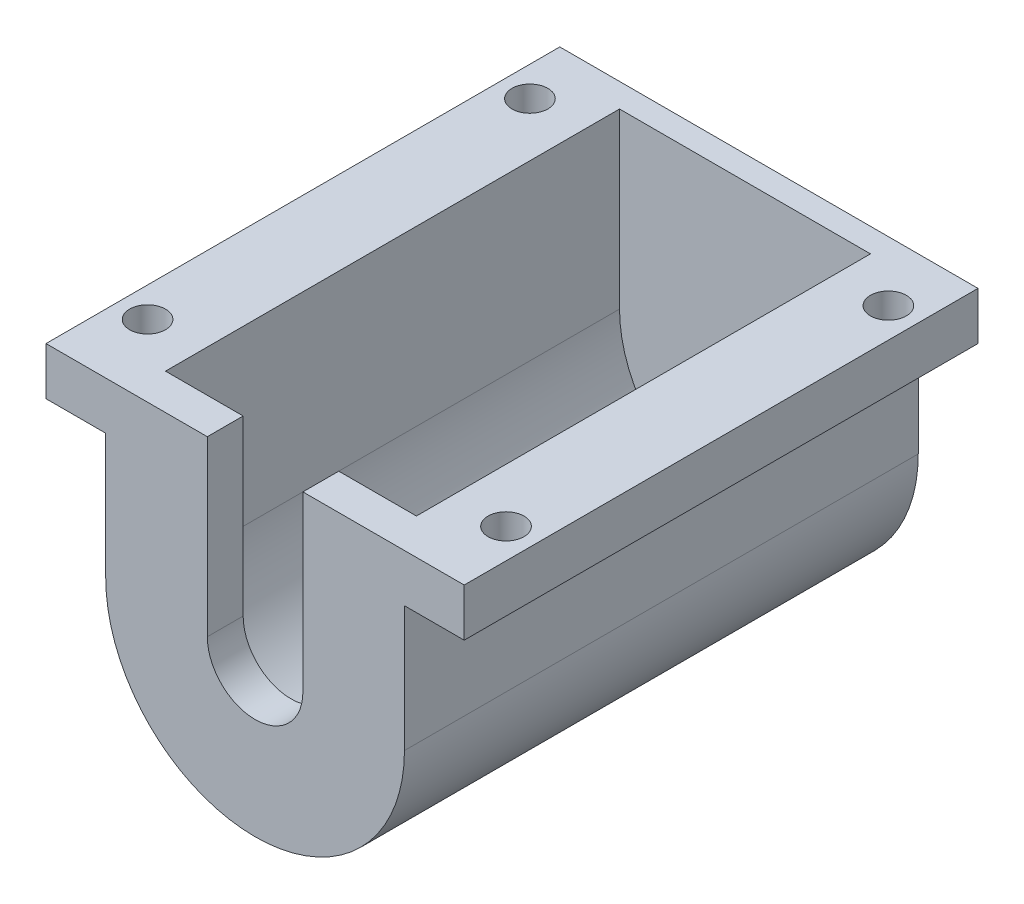
ISO-10303-21;
HEADER;
FILE_DESCRIPTION(('STEP AP214'),'2;1');
FILE_NAME('part.step','',(''),(''),'','','');
FILE_SCHEMA(('AUTOMOTIVE_DESIGN { 1 0 10303 214 1 1 1 1 }'));
ENDSEC;
DATA;
#1=APPLICATION_CONTEXT('core data for automotive mechanical design processes');
#2=APPLICATION_PROTOCOL_DEFINITION('international standard','automotive_design',2000,#1);
#3=PRODUCT_CONTEXT('',#1,'mechanical');
#4=PRODUCT('Part','Part','',(#3));
#5=PRODUCT_RELATED_PRODUCT_CATEGORY('part','',(#4));
#6=PRODUCT_DEFINITION_FORMATION('','',#4);
#7=PRODUCT_DEFINITION_CONTEXT('part definition',#1,'design');
#8=PRODUCT_DEFINITION('design','',#6,#7);
#9=PRODUCT_DEFINITION_SHAPE('','',#8);
#10=(LENGTH_UNIT() NAMED_UNIT(*) SI_UNIT(.MILLI.,.METRE.));
#11=(NAMED_UNIT(*) PLANE_ANGLE_UNIT() SI_UNIT($,.RADIAN.));
#12=(NAMED_UNIT(*) SI_UNIT($,.STERADIAN.) SOLID_ANGLE_UNIT());
#13=UNCERTAINTY_MEASURE_WITH_UNIT(LENGTH_MEASURE(1.E-05),#10,'distance_accuracy_value','');
#14=(GEOMETRIC_REPRESENTATION_CONTEXT(3) GLOBAL_UNCERTAINTY_ASSIGNED_CONTEXT((#13)) GLOBAL_UNIT_ASSIGNED_CONTEXT((#10,
#11,#12)) REPRESENTATION_CONTEXT('',''));
#15=CARTESIAN_POINT('',(0.,0.,0.));
#16=DIRECTION('',(0.,0.,1.));
#17=DIRECTION('',(1.,0.,0.));
#18=AXIS2_PLACEMENT_3D('',#15,#16,#17);
#19=CARTESIAN_POINT('',(12.5,10.5,38.));
#20=DIRECTION('',(-1.,0.,0.));
#21=DIRECTION('',(0.,0.,1.));
#22=AXIS2_PLACEMENT_3D('',#19,#20,#21);
#23=PLANE('',#22);
#24=DIRECTION('',(0.,0.,-1.));
#25=VECTOR('',#24,1.);
#26=CARTESIAN_POINT('',(12.5,0.,38.));
#27=LINE('',#26,#25);
#28=CARTESIAN_POINT('',(12.5,0.,41.));
#29=VERTEX_POINT('',#28);
#30=CARTESIAN_POINT('',(12.5,0.,-2.));
#31=VERTEX_POINT('',#30);
#32=EDGE_CURVE('E220',#29,#31,#27,.T.);
#33=ORIENTED_EDGE('',*,*,#32,.T.);
#34=DIRECTION('',(0.,-1.,0.));
#35=VECTOR('',#34,1.);
#36=CARTESIAN_POINT('',(12.5,10.5,-2.));
#37=LINE('',#36,#35);
#38=CARTESIAN_POINT('',(12.5,10.5,-2.));
#39=VERTEX_POINT('',#38);
#40=EDGE_CURVE('E169',#39,#31,#37,.T.);
#41=ORIENTED_EDGE('',*,*,#40,.F.);
#42=DIRECTION('',(0.,0.,-1.));
#43=VECTOR('',#42,1.);
#44=CARTESIAN_POINT('',(12.5,10.5,38.));
#45=LINE('',#44,#43);
#46=CARTESIAN_POINT('',(12.5,10.5,41.));
#47=VERTEX_POINT('',#46);
#48=EDGE_CURVE('E11',#47,#39,#45,.T.);
#49=ORIENTED_EDGE('',*,*,#48,.F.);
#50=DIRECTION('',(0.,1.,0.));
#51=VECTOR('',#50,1.);
#52=CARTESIAN_POINT('',(12.5,10.5,41.));
#53=LINE('',#52,#51);
#54=EDGE_CURVE('E192',#29,#47,#53,.T.);
#55=ORIENTED_EDGE('',*,*,#54,.F.);
#56=EDGE_LOOP('',(#33,#41,#49,#55));
#57=FACE_BOUND('',#56,.T.);
#58=ADVANCED_FACE('F32',(#57),#23,.F.);
#59=CARTESIAN_POINT('',(10.5,10.5,38.));
#60=DIRECTION('',(1.,0.,0.));
#61=DIRECTION('',(0.,1.,0.));
#62=AXIS2_PLACEMENT_3D('',#59,#60,#61);
#63=PLANE('',#62);
#64=DIRECTION('',(0.,-1.,0.));
#65=VECTOR('',#64,1.);
#66=CARTESIAN_POINT('',(10.5,10.5,0.));
#67=LINE('',#66,#65);
#68=CARTESIAN_POINT('',(10.5,14.5,0.));
#69=VERTEX_POINT('',#68);
#70=CARTESIAN_POINT('',(10.5,0.,0.));
#71=VERTEX_POINT('',#70);
#72=EDGE_CURVE('E210',#69,#71,#67,.T.);
#73=ORIENTED_EDGE('',*,*,#72,.T.);
#74=DIRECTION('',(0.,0.,-1.));
#75=VECTOR('',#74,1.);
#76=CARTESIAN_POINT('',(10.5,0.,38.));
#77=LINE('',#76,#75);
#78=CARTESIAN_POINT('',(10.5,0.,38.));
#79=VERTEX_POINT('',#78);
#80=EDGE_CURVE('E40',#79,#71,#77,.T.);
#81=ORIENTED_EDGE('',*,*,#80,.F.);
#82=DIRECTION('',(0.,-1.,0.));
#83=VECTOR('',#82,1.);
#84=CARTESIAN_POINT('',(10.5,10.5,38.));
#85=LINE('',#84,#83);
#86=CARTESIAN_POINT('',(10.5,14.5,38.));
#87=VERTEX_POINT('',#86);
#88=EDGE_CURVE('E211',#87,#79,#85,.T.);
#89=ORIENTED_EDGE('',*,*,#88,.F.);
#90=DIRECTION('',(0.,0.,1.));
#91=VECTOR('',#90,1.);
#92=CARTESIAN_POINT('',(10.5,14.5,0.));
#93=LINE('',#92,#91);
#94=EDGE_CURVE('E239',#69,#87,#93,.T.);
#95=ORIENTED_EDGE('',*,*,#94,.F.);
#96=EDGE_LOOP('',(#73,#81,#89,#95));
#97=FACE_BOUND('',#96,.T.);
#98=ADVANCED_FACE('F236',(#97),#63,.F.);
#99=CARTESIAN_POINT('',(0.,0.,38.));
#100=DIRECTION('',(0.,0.,-1.));
#101=DIRECTION('',(-1.,0.,0.));
#102=AXIS2_PLACEMENT_3D('',#99,#100,#101);
#103=CYLINDRICAL_SURFACE('',#102,10.5);
#104=CARTESIAN_POINT('',(0.,0.,0.));
#105=DIRECTION('',(0.,0.,-1.));
#106=DIRECTION('',(1.,0.,0.));
#107=AXIS2_PLACEMENT_3D('',#104,#105,#106);
#108=CIRCLE('',#107,10.5);
#109=CARTESIAN_POINT('',(-10.5,0.,0.));
#110=VERTEX_POINT('',#109);
#111=EDGE_CURVE('E223',#71,#110,#108,.T.);
#112=ORIENTED_EDGE('',*,*,#111,.T.);
#113=DIRECTION('',(0.,0.,-1.));
#114=VECTOR('',#113,1.);
#115=CARTESIAN_POINT('',(-10.5,0.,38.));
#116=LINE('',#115,#114);
#117=CARTESIAN_POINT('',(-10.5,0.,38.));
#118=VERTEX_POINT('',#117);
#119=EDGE_CURVE('E47',#118,#110,#116,.T.);
#120=ORIENTED_EDGE('',*,*,#119,.F.);
#121=CARTESIAN_POINT('',(0.,0.,38.));
#122=DIRECTION('',(0.,0.,-1.));
#123=DIRECTION('',(1.,0.,0.));
#124=AXIS2_PLACEMENT_3D('',#121,#122,#123);
#125=CIRCLE('',#124,10.5);
#126=EDGE_CURVE('E214',#79,#118,#125,.T.);
#127=ORIENTED_EDGE('',*,*,#126,.F.);
#128=ORIENTED_EDGE('',*,*,#80,.T.);
#129=EDGE_LOOP('',(#112,#120,#127,#128));
#130=FACE_BOUND('',#129,.T.);
#131=ADVANCED_FACE('F233',(#130),#103,.F.);
#132=CARTESIAN_POINT('',(-10.5,0.,38.));
#133=DIRECTION('',(-1.,0.,0.));
#134=DIRECTION('',(0.,0.,1.));
#135=AXIS2_PLACEMENT_3D('',#132,#133,#134);
#136=PLANE('',#135);
#137=DIRECTION('',(0.,1.,0.));
#138=VECTOR('',#137,1.);
#139=CARTESIAN_POINT('',(-10.5,0.,0.));
#140=LINE('',#139,#138);
#141=CARTESIAN_POINT('',(-10.5,14.5,0.));
#142=VERTEX_POINT('',#141);
#143=EDGE_CURVE('E215',#110,#142,#140,.T.);
#144=ORIENTED_EDGE('',*,*,#143,.T.);
#145=DIRECTION('',(0.,0.,-1.));
#146=VECTOR('',#145,1.);
#147=CARTESIAN_POINT('',(-10.5,14.5,0.));
#148=LINE('',#147,#146);
#149=CARTESIAN_POINT('',(-10.5,14.5,38.));
#150=VERTEX_POINT('',#149);
#151=EDGE_CURVE('E250',#150,#142,#148,.T.);
#152=ORIENTED_EDGE('',*,*,#151,.F.);
#153=DIRECTION('',(0.,1.,0.));
#154=VECTOR('',#153,1.);
#155=CARTESIAN_POINT('',(-10.5,0.,38.));
#156=LINE('',#155,#154);
#157=EDGE_CURVE('E218',#118,#150,#156,.T.);
#158=ORIENTED_EDGE('',*,*,#157,.F.);
#159=ORIENTED_EDGE('',*,*,#119,.T.);
#160=EDGE_LOOP('',(#144,#152,#158,#159));
#161=FACE_BOUND('',#160,.T.);
#162=ADVANCED_FACE('F326',(#161),#136,.F.);
#163=CARTESIAN_POINT('',(-12.5,0.,38.));
#164=DIRECTION('',(1.,0.,0.));
#165=DIRECTION('',(0.,1.,0.));
#166=AXIS2_PLACEMENT_3D('',#163,#164,#165);
#167=PLANE('',#166);
#168=DIRECTION('',(0.,0.,-1.));
#169=VECTOR('',#168,1.);
#170=CARTESIAN_POINT('',(-12.5,10.5,38.));
#171=LINE('',#170,#169);
#172=CARTESIAN_POINT('',(-12.5,10.5,41.));
#173=VERTEX_POINT('',#172);
#174=CARTESIAN_POINT('',(-12.5,10.5,-2.));
#175=VERTEX_POINT('',#174);
#176=EDGE_CURVE('E229',#173,#175,#171,.T.);
#177=ORIENTED_EDGE('',*,*,#176,.T.);
#178=DIRECTION('',(0.,1.,0.));
#179=VECTOR('',#178,1.);
#180=CARTESIAN_POINT('',(-12.5,10.5,-2.));
#181=LINE('',#180,#179);
#182=CARTESIAN_POINT('',(-12.5,0.,-2.));
#183=VERTEX_POINT('',#182);
#184=EDGE_CURVE('E182',#183,#175,#181,.T.);
#185=ORIENTED_EDGE('',*,*,#184,.F.);
#186=DIRECTION('',(0.,0.,-1.));
#187=VECTOR('',#186,1.);
#188=CARTESIAN_POINT('',(-12.5,0.,38.));
#189=LINE('',#188,#187);
#190=CARTESIAN_POINT('',(-12.5,0.,41.));
#191=VERTEX_POINT('',#190);
#192=EDGE_CURVE('E227',#191,#183,#189,.T.);
#193=ORIENTED_EDGE('',*,*,#192,.F.);
#194=DIRECTION('',(0.,-1.,0.));
#195=VECTOR('',#194,1.);
#196=CARTESIAN_POINT('',(-12.5,10.5,41.));
#197=LINE('',#196,#195);
#198=EDGE_CURVE('E186',#173,#191,#197,.T.);
#199=ORIENTED_EDGE('',*,*,#198,.F.);
#200=EDGE_LOOP('',(#177,#185,#193,#199));
#201=FACE_BOUND('',#200,.T.);
#202=ADVANCED_FACE('F302',(#201),#167,.F.);
#203=CARTESIAN_POINT('',(0.,0.,38.));
#204=DIRECTION('',(0.,0.,-1.));
#205=DIRECTION('',(-1.,0.,0.));
#206=AXIS2_PLACEMENT_3D('',#203,#204,#205);
#207=CYLINDRICAL_SURFACE('',#206,12.5);
#208=ORIENTED_EDGE('',*,*,#192,.T.);
#209=CARTESIAN_POINT('',(0.,0.,-2.));
#210=DIRECTION('',(0.,0.,-1.));
#211=DIRECTION('',(-1.,0.,0.));
#212=AXIS2_PLACEMENT_3D('',#209,#210,#211);
#213=CIRCLE('',#212,12.5);
#214=EDGE_CURVE('E173',#31,#183,#213,.T.);
#215=ORIENTED_EDGE('',*,*,#214,.F.);
#216=ORIENTED_EDGE('',*,*,#32,.F.);
#217=CARTESIAN_POINT('',(0.,0.,41.));
#218=DIRECTION('',(0.,0.,1.));
#219=DIRECTION('',(1.,0.,0.));
#220=AXIS2_PLACEMENT_3D('',#217,#218,#219);
#221=CIRCLE('',#220,12.5);
#222=EDGE_CURVE('E188',#191,#29,#221,.T.);
#223=ORIENTED_EDGE('',*,*,#222,.F.);
#224=EDGE_LOOP('',(#208,#215,#216,#223));
#225=FACE_BOUND('',#224,.T.);
#226=ADVANCED_FACE('F298',(#225),#207,.T.);
#227=CARTESIAN_POINT('',(0.,0.,38.));
#228=DIRECTION('',(0.,0.,1.));
#229=DIRECTION('',(1.,0.,0.));
#230=AXIS2_PLACEMENT_3D('',#227,#228,#229);
#231=PLANE('',#230);
#232=DIRECTION('',(0.,-1.,0.));
#233=VECTOR('',#232,1.);
#234=CARTESIAN_POINT('',(4.,0.,38.));
#235=LINE('',#234,#233);
#236=CARTESIAN_POINT('',(4.,14.5,38.));
#237=VERTEX_POINT('',#236);
#238=CARTESIAN_POINT('',(4.,0.,38.));
#239=VERTEX_POINT('',#238);
#240=EDGE_CURVE('E185',#237,#239,#235,.T.);
#241=ORIENTED_EDGE('',*,*,#240,.F.);
#242=DIRECTION('',(-1.,0.,0.));
#243=VECTOR('',#242,1.);
#244=CARTESIAN_POINT('',(10.5,14.5,38.));
#245=LINE('',#244,#243);
#246=EDGE_CURVE('E252',#87,#237,#245,.T.);
#247=ORIENTED_EDGE('',*,*,#246,.F.);
#248=ORIENTED_EDGE('',*,*,#88,.T.);
#249=ORIENTED_EDGE('',*,*,#126,.T.);
#250=ORIENTED_EDGE('',*,*,#157,.T.);
#251=DIRECTION('',(-1.,0.,0.));
#252=VECTOR('',#251,1.);
#253=CARTESIAN_POINT('',(-10.5,14.5,38.));
#254=LINE('',#253,#252);
#255=CARTESIAN_POINT('',(-4.,14.5,38.));
#256=VERTEX_POINT('',#255);
#257=EDGE_CURVE('E254',#256,#150,#254,.T.);
#258=ORIENTED_EDGE('',*,*,#257,.F.);
#259=DIRECTION('',(0.,1.,0.));
#260=VECTOR('',#259,1.);
#261=CARTESIAN_POINT('',(-4.,10.5,38.));
#262=LINE('',#261,#260);
#263=CARTESIAN_POINT('',(-4.,0.,38.));
#264=VERTEX_POINT('',#263);
#265=EDGE_CURVE('E189',#264,#256,#262,.T.);
#266=ORIENTED_EDGE('',*,*,#265,.F.);
#267=CARTESIAN_POINT('',(0.,0.,38.));
#268=DIRECTION('',(0.,0.,-1.));
#269=DIRECTION('',(1.,0.,0.));
#270=AXIS2_PLACEMENT_3D('',#267,#268,#269);
#271=CIRCLE('',#270,4.);
#272=EDGE_CURVE('E202',#239,#264,#271,.T.);
#273=ORIENTED_EDGE('',*,*,#272,.F.);
#274=EDGE_LOOP('',(#241,#247,#248,#249,#250,#258,#266,#273));
#275=FACE_BOUND('',#274,.T.);
#276=ADVANCED_FACE('F336',(#275),#231,.F.);
#277=CARTESIAN_POINT('',(4.,0.,41.));
#278=DIRECTION('',(1.,0.,0.));
#279=DIRECTION('',(0.,0.,-1.));
#280=AXIS2_PLACEMENT_3D('',#277,#278,#279);
#281=PLANE('',#280);
#282=ORIENTED_EDGE('',*,*,#240,.T.);
#283=DIRECTION('',(0.,0.,-1.));
#284=VECTOR('',#283,1.);
#285=CARTESIAN_POINT('',(4.,0.,41.));
#286=LINE('',#285,#284);
#287=CARTESIAN_POINT('',(4.,0.,41.));
#288=VERTEX_POINT('',#287);
#289=EDGE_CURVE('E207',#288,#239,#286,.T.);
#290=ORIENTED_EDGE('',*,*,#289,.F.);
#291=DIRECTION('',(0.,-1.,0.));
#292=VECTOR('',#291,1.);
#293=CARTESIAN_POINT('',(4.,0.,41.));
#294=LINE('',#293,#292);
#295=CARTESIAN_POINT('',(4.,14.5,41.));
#296=VERTEX_POINT('',#295);
#297=EDGE_CURVE('E195',#296,#288,#294,.T.);
#298=ORIENTED_EDGE('',*,*,#297,.F.);
#299=DIRECTION('',(0.,0.,1.));
#300=VECTOR('',#299,1.);
#301=CARTESIAN_POINT('',(4.,14.5,38.));
#302=LINE('',#301,#300);
#303=EDGE_CURVE('E259',#237,#296,#302,.T.);
#304=ORIENTED_EDGE('',*,*,#303,.F.);
#305=EDGE_LOOP('',(#282,#290,#298,#304));
#306=FACE_BOUND('',#305,.T.);
#307=ADVANCED_FACE('F337',(#306),#281,.F.);
#308=CARTESIAN_POINT('',(0.,0.,41.));
#309=DIRECTION('',(0.,0.,-1.));
#310=DIRECTION('',(-1.,0.,0.));
#311=AXIS2_PLACEMENT_3D('',#308,#309,#310);
#312=CYLINDRICAL_SURFACE('',#311,4.);
#313=ORIENTED_EDGE('',*,*,#272,.T.);
#314=DIRECTION('',(0.,0.,-1.));
#315=VECTOR('',#314,1.);
#316=CARTESIAN_POINT('',(-4.,0.,41.));
#317=LINE('',#316,#315);
#318=CARTESIAN_POINT('',(-4.,0.,41.));
#319=VERTEX_POINT('',#318);
#320=EDGE_CURVE('E200',#319,#264,#317,.T.);
#321=ORIENTED_EDGE('',*,*,#320,.F.);
#322=CARTESIAN_POINT('',(0.,0.,41.));
#323=DIRECTION('',(0.,0.,-1.));
#324=DIRECTION('',(1.,0.,0.));
#325=AXIS2_PLACEMENT_3D('',#322,#323,#324);
#326=CIRCLE('',#325,4.);
#327=EDGE_CURVE('E197',#288,#319,#326,.T.);
#328=ORIENTED_EDGE('',*,*,#327,.F.);
#329=ORIENTED_EDGE('',*,*,#289,.T.);
#330=EDGE_LOOP('',(#313,#321,#328,#329));
#331=FACE_BOUND('',#330,.T.);
#332=ADVANCED_FACE('F340',(#331),#312,.F.);
#333=CARTESIAN_POINT('',(-4.,10.5,41.));
#334=DIRECTION('',(-1.,0.,0.));
#335=DIRECTION('',(0.,0.,1.));
#336=AXIS2_PLACEMENT_3D('',#333,#334,#335);
#337=PLANE('',#336);
#338=ORIENTED_EDGE('',*,*,#265,.T.);
#339=DIRECTION('',(0.,0.,-1.));
#340=VECTOR('',#339,1.);
#341=CARTESIAN_POINT('',(-4.,14.5,38.));
#342=LINE('',#341,#340);
#343=CARTESIAN_POINT('',(-4.,14.5,41.));
#344=VERTEX_POINT('',#343);
#345=EDGE_CURVE('E153',#344,#256,#342,.T.);
#346=ORIENTED_EDGE('',*,*,#345,.F.);
#347=DIRECTION('',(0.,1.,0.));
#348=VECTOR('',#347,1.);
#349=CARTESIAN_POINT('',(-4.,10.5,41.));
#350=LINE('',#349,#348);
#351=EDGE_CURVE('E149',#319,#344,#350,.T.);
#352=ORIENTED_EDGE('',*,*,#351,.F.);
#353=ORIENTED_EDGE('',*,*,#320,.T.);
#354=EDGE_LOOP('',(#338,#346,#352,#353));
#355=FACE_BOUND('',#354,.T.);
#356=ADVANCED_FACE('F344',(#355),#337,.F.);
#357=CARTESIAN_POINT('',(0.,0.,41.));
#358=DIRECTION('',(0.,0.,1.));
#359=DIRECTION('',(1.,0.,0.));
#360=AXIS2_PLACEMENT_3D('',#357,#358,#359);
#361=PLANE('',#360);
#362=ORIENTED_EDGE('',*,*,#198,.T.);
#363=ORIENTED_EDGE('',*,*,#222,.T.);
#364=ORIENTED_EDGE('',*,*,#54,.T.);
#365=DIRECTION('',(1.,0.,0.));
#366=VECTOR('',#365,1.);
#367=CARTESIAN_POINT('',(17.5,10.5,41.));
#368=LINE('',#367,#366);
#369=CARTESIAN_POINT('',(17.5,10.5,41.));
#370=VERTEX_POINT('',#369);
#371=EDGE_CURVE('E272',#47,#370,#368,.T.);
#372=ORIENTED_EDGE('',*,*,#371,.T.);
#373=DIRECTION('',(0.,-1.,0.));
#374=VECTOR('',#373,1.);
#375=CARTESIAN_POINT('',(17.5,14.5,41.));
#376=LINE('',#375,#374);
#377=CARTESIAN_POINT('',(17.5,14.5,41.));
#378=VERTEX_POINT('',#377);
#379=EDGE_CURVE('E170',#378,#370,#376,.T.);
#380=ORIENTED_EDGE('',*,*,#379,.F.);
#381=DIRECTION('',(1.,0.,0.));
#382=VECTOR('',#381,1.);
#383=CARTESIAN_POINT('',(17.5,14.5,41.));
#384=LINE('',#383,#382);
#385=EDGE_CURVE('E262',#296,#378,#384,.T.);
#386=ORIENTED_EDGE('',*,*,#385,.F.);
#387=ORIENTED_EDGE('',*,*,#297,.T.);
#388=ORIENTED_EDGE('',*,*,#327,.T.);
#389=ORIENTED_EDGE('',*,*,#351,.T.);
#390=DIRECTION('',(1.,0.,0.));
#391=VECTOR('',#390,1.);
#392=CARTESIAN_POINT('',(-4.,14.5,41.));
#393=LINE('',#392,#391);
#394=CARTESIAN_POINT('',(-17.5,14.5,41.));
#395=VERTEX_POINT('',#394);
#396=EDGE_CURVE('E140',#395,#344,#393,.T.);
#397=ORIENTED_EDGE('',*,*,#396,.F.);
#398=DIRECTION('',(0.,-1.,0.));
#399=VECTOR('',#398,1.);
#400=CARTESIAN_POINT('',(-17.5,14.5,41.));
#401=LINE('',#400,#399);
#402=CARTESIAN_POINT('',(-17.5,10.5,41.));
#403=VERTEX_POINT('',#402);
#404=EDGE_CURVE('E146',#395,#403,#401,.T.);
#405=ORIENTED_EDGE('',*,*,#404,.T.);
#406=DIRECTION('',(1.,0.,0.));
#407=VECTOR('',#406,1.);
#408=CARTESIAN_POINT('',(-4.,10.5,41.));
#409=LINE('',#408,#407);
#410=EDGE_CURVE('E269',#403,#173,#409,.T.);
#411=ORIENTED_EDGE('',*,*,#410,.T.);
#412=EDGE_LOOP('',(#362,#363,#364,#372,#380,#386,#387,#388,#389,#397,#405,#411));
#413=FACE_BOUND('',#412,.T.);
#414=ADVANCED_FACE('F143',(#413),#361,.T.);
#415=CARTESIAN_POINT('',(0.,0.,-2.));
#416=DIRECTION('',(0.,0.,-1.));
#417=DIRECTION('',(-1.,0.,0.));
#418=AXIS2_PLACEMENT_3D('',#415,#416,#417);
#419=PLANE('',#418);
#420=ORIENTED_EDGE('',*,*,#40,.T.);
#421=ORIENTED_EDGE('',*,*,#214,.T.);
#422=ORIENTED_EDGE('',*,*,#184,.T.);
#423=DIRECTION('',(-1.,0.,0.));
#424=VECTOR('',#423,1.);
#425=CARTESIAN_POINT('',(-17.5,10.5,-2.));
#426=LINE('',#425,#424);
#427=CARTESIAN_POINT('',(-17.5,10.5,-2.));
#428=VERTEX_POINT('',#427);
#429=EDGE_CURVE('E276',#175,#428,#426,.T.);
#430=ORIENTED_EDGE('',*,*,#429,.T.);
#431=DIRECTION('',(0.,-1.,0.));
#432=VECTOR('',#431,1.);
#433=CARTESIAN_POINT('',(-17.5,14.5,-2.));
#434=LINE('',#433,#432);
#435=CARTESIAN_POINT('',(-17.5,14.5,-2.));
#436=VERTEX_POINT('',#435);
#437=EDGE_CURVE('E267',#436,#428,#434,.T.);
#438=ORIENTED_EDGE('',*,*,#437,.F.);
#439=DIRECTION('',(-1.,0.,0.));
#440=VECTOR('',#439,1.);
#441=CARTESIAN_POINT('',(-17.5,14.5,-2.));
#442=LINE('',#441,#440);
#443=CARTESIAN_POINT('',(17.5,14.5,-2.));
#444=VERTEX_POINT('',#443);
#445=EDGE_CURVE('E160',#444,#436,#442,.T.);
#446=ORIENTED_EDGE('',*,*,#445,.F.);
#447=DIRECTION('',(0.,-1.,0.));
#448=VECTOR('',#447,1.);
#449=CARTESIAN_POINT('',(17.5,14.5,-2.));
#450=LINE('',#449,#448);
#451=CARTESIAN_POINT('',(17.5,10.5,-2.));
#452=VERTEX_POINT('',#451);
#453=EDGE_CURVE('E176',#444,#452,#450,.T.);
#454=ORIENTED_EDGE('',*,*,#453,.T.);
#455=EDGE_CURVE('E164',#452,#39,#426,.T.);
#456=ORIENTED_EDGE('',*,*,#455,.T.);
#457=EDGE_LOOP('',(#420,#421,#422,#430,#438,#446,#454,#456));
#458=FACE_BOUND('',#457,.T.);
#459=ADVANCED_FACE('F283',(#458),#419,.T.);
#460=CARTESIAN_POINT('',(0.,0.,0.));
#461=DIRECTION('',(0.,0.,-1.));
#462=DIRECTION('',(-1.,0.,0.));
#463=AXIS2_PLACEMENT_3D('',#460,#461,#462);
#464=PLANE('',#463);
#465=ORIENTED_EDGE('',*,*,#143,.F.);
#466=ORIENTED_EDGE('',*,*,#111,.F.);
#467=ORIENTED_EDGE('',*,*,#72,.F.);
#468=DIRECTION('',(1.,0.,0.));
#469=VECTOR('',#468,1.);
#470=CARTESIAN_POINT('',(-10.5,14.5,0.));
#471=LINE('',#470,#469);
#472=EDGE_CURVE('E244',#142,#69,#471,.T.);
#473=ORIENTED_EDGE('',*,*,#472,.F.);
#474=EDGE_LOOP('',(#465,#466,#467,#473));
#475=FACE_BOUND('',#474,.T.);
#476=ADVANCED_FACE('F243',(#475),#464,.F.);
#477=CARTESIAN_POINT('',(0.,10.5,0.));
#478=DIRECTION('',(0.,-1.,0.));
#479=DIRECTION('',(0.,0.,-1.));
#480=AXIS2_PLACEMENT_3D('',#477,#478,#479);
#481=PLANE('',#480);
#482=CARTESIAN_POINT('',(-14.9999999999997,10.5,35.));
#483=DIRECTION('',(0.,1.,0.));
#484=DIRECTION('',(0.,0.,1.));
#485=AXIS2_PLACEMENT_3D('',#482,#483,#484);
#486=CIRCLE('',#485,1.5);
#487=CARTESIAN_POINT('',(-14.9999999999997,10.5,36.5));
#488=VERTEX_POINT('',#487);
#489=EDGE_CURVE('E394',#488,#488,#486,.T.);
#490=ORIENTED_EDGE('',*,*,#489,.T.);
#491=EDGE_LOOP('',(#490));
#492=FACE_BOUND('',#491,.T.);
#493=CARTESIAN_POINT('',(-15.,10.5,3.));
#494=DIRECTION('',(0.,1.,0.));
#495=DIRECTION('',(0.,0.,1.));
#496=AXIS2_PLACEMENT_3D('',#493,#494,#495);
#497=CIRCLE('',#496,1.5);
#498=CARTESIAN_POINT('',(-15.,10.5,4.5));
#499=VERTEX_POINT('',#498);
#500=EDGE_CURVE('E376',#499,#499,#497,.T.);
#501=ORIENTED_EDGE('',*,*,#500,.T.);
#502=EDGE_LOOP('',(#501));
#503=FACE_BOUND('',#502,.T.);
#504=ORIENTED_EDGE('',*,*,#176,.F.);
#505=ORIENTED_EDGE('',*,*,#410,.F.);
#506=DIRECTION('',(0.,0.,1.));
#507=VECTOR('',#506,1.);
#508=CARTESIAN_POINT('',(-17.5,10.5,41.));
#509=LINE('',#508,#507);
#510=EDGE_CURVE('E168',#428,#403,#509,.T.);
#511=ORIENTED_EDGE('',*,*,#510,.F.);
#512=ORIENTED_EDGE('',*,*,#429,.F.);
#513=EDGE_LOOP('',(#504,#505,#511,#512));
#514=FACE_BOUND('',#513,.T.);
#515=ADVANCED_FACE('F304',(#492,#503,#514),#481,.T.);
#516=CARTESIAN_POINT('',(0.,14.5,0.));
#517=DIRECTION('',(0.,-1.,0.));
#518=DIRECTION('',(0.,0.,-1.));
#519=AXIS2_PLACEMENT_3D('',#516,#517,#518);
#520=PLANE('',#519);
#521=DIRECTION('',(0.,0.,1.));
#522=VECTOR('',#521,1.);
#523=CARTESIAN_POINT('',(-17.5,14.5,41.));
#524=LINE('',#523,#522);
#525=EDGE_CURVE('E154',#436,#395,#524,.T.);
#526=ORIENTED_EDGE('',*,*,#525,.T.);
#527=ORIENTED_EDGE('',*,*,#396,.T.);
#528=ORIENTED_EDGE('',*,*,#345,.T.);
#529=ORIENTED_EDGE('',*,*,#257,.T.);
#530=ORIENTED_EDGE('',*,*,#151,.T.);
#531=ORIENTED_EDGE('',*,*,#472,.T.);
#532=ORIENTED_EDGE('',*,*,#94,.T.);
#533=ORIENTED_EDGE('',*,*,#246,.T.);
#534=ORIENTED_EDGE('',*,*,#303,.T.);
#535=ORIENTED_EDGE('',*,*,#385,.T.);
#536=DIRECTION('',(0.,0.,-1.));
#537=VECTOR('',#536,1.);
#538=CARTESIAN_POINT('',(17.5,14.5,-2.));
#539=LINE('',#538,#537);
#540=EDGE_CURVE('E264',#378,#444,#539,.T.);
#541=ORIENTED_EDGE('',*,*,#540,.T.);
#542=ORIENTED_EDGE('',*,*,#445,.T.);
#543=EDGE_LOOP('',(#526,#527,#528,#529,#530,#531,#532,#533,#534,#535,#541,#542));
#544=FACE_BOUND('',#543,.T.);
#545=CARTESIAN_POINT('',(-15.,14.5,3.));
#546=DIRECTION('',(0.,1.,0.));
#547=DIRECTION('',(0.,0.,1.));
#548=AXIS2_PLACEMENT_3D('',#545,#546,#547);
#549=CIRCLE('',#548,1.5);
#550=CARTESIAN_POINT('',(-15.,14.5,4.5));
#551=VERTEX_POINT('',#550);
#552=EDGE_CURVE('E270',#551,#551,#549,.T.);
#553=ORIENTED_EDGE('',*,*,#552,.F.);
#554=EDGE_LOOP('',(#553));
#555=FACE_BOUND('',#554,.T.);
#556=CARTESIAN_POINT('',(15.,14.5,3.));
#557=DIRECTION('',(0.,1.,0.));
#558=DIRECTION('',(0.,0.,1.));
#559=AXIS2_PLACEMENT_3D('',#556,#557,#558);
#560=CIRCLE('',#559,1.5);
#561=CARTESIAN_POINT('',(15.,14.5,4.5));
#562=VERTEX_POINT('',#561);
#563=EDGE_CURVE('E379',#562,#562,#560,.T.);
#564=ORIENTED_EDGE('',*,*,#563,.F.);
#565=EDGE_LOOP('',(#564));
#566=FACE_BOUND('',#565,.T.);
#567=CARTESIAN_POINT('',(15.0000000000003,14.5,35.));
#568=DIRECTION('',(0.,1.,0.));
#569=DIRECTION('',(0.,0.,1.));
#570=AXIS2_PLACEMENT_3D('',#567,#568,#569);
#571=CIRCLE('',#570,1.5);
#572=CARTESIAN_POINT('',(15.0000000000003,14.5,36.5));
#573=VERTEX_POINT('',#572);
#574=EDGE_CURVE('E385',#573,#573,#571,.T.);
#575=ORIENTED_EDGE('',*,*,#574,.F.);
#576=EDGE_LOOP('',(#575));
#577=FACE_BOUND('',#576,.T.);
#578=CARTESIAN_POINT('',(-14.9999999999997,14.5,35.));
#579=DIRECTION('',(0.,1.,0.));
#580=DIRECTION('',(0.,0.,1.));
#581=AXIS2_PLACEMENT_3D('',#578,#579,#580);
#582=CIRCLE('',#581,1.5);
#583=CARTESIAN_POINT('',(-14.9999999999997,14.5,36.5));
#584=VERTEX_POINT('',#583);
#585=EDGE_CURVE('E391',#584,#584,#582,.T.);
#586=ORIENTED_EDGE('',*,*,#585,.F.);
#587=EDGE_LOOP('',(#586));
#588=FACE_BOUND('',#587,.T.);
#589=ADVANCED_FACE('F157',(#544,#555,#566,#577,#588),#520,.F.);
#590=CARTESIAN_POINT('',(15.0000000000003,10.5,35.));
#591=DIRECTION('',(0.,1.,0.));
#592=DIRECTION('',(0.,0.,1.));
#593=AXIS2_PLACEMENT_3D('',#590,#591,#592);
#594=CIRCLE('',#593,1.5);
#595=CARTESIAN_POINT('',(15.0000000000003,10.5,36.5));
#596=VERTEX_POINT('',#595);
#597=EDGE_CURVE('E388',#596,#596,#594,.T.);
#598=ORIENTED_EDGE('',*,*,#597,.T.);
#599=EDGE_LOOP('',(#598));
#600=FACE_BOUND('',#599,.T.);
#601=ORIENTED_EDGE('',*,*,#371,.F.);
#602=ORIENTED_EDGE('',*,*,#48,.T.);
#603=ORIENTED_EDGE('',*,*,#455,.F.);
#604=DIRECTION('',(0.,0.,-1.));
#605=VECTOR('',#604,1.);
#606=CARTESIAN_POINT('',(17.5,10.5,-2.));
#607=LINE('',#606,#605);
#608=EDGE_CURVE('E274',#370,#452,#607,.T.);
#609=ORIENTED_EDGE('',*,*,#608,.F.);
#610=EDGE_LOOP('',(#601,#602,#603,#609));
#611=FACE_BOUND('',#610,.T.);
#612=CARTESIAN_POINT('',(15.,10.5,3.));
#613=DIRECTION('',(0.,1.,0.));
#614=DIRECTION('',(0.,0.,1.));
#615=AXIS2_PLACEMENT_3D('',#612,#613,#614);
#616=CIRCLE('',#615,1.5);
#617=CARTESIAN_POINT('',(15.,10.5,4.5));
#618=VERTEX_POINT('',#617);
#619=EDGE_CURVE('E382',#618,#618,#616,.T.);
#620=ORIENTED_EDGE('',*,*,#619,.T.);
#621=EDGE_LOOP('',(#620));
#622=FACE_BOUND('',#621,.T.);
#623=ADVANCED_FACE('F289',(#600,#611,#622),#481,.T.);
#624=CARTESIAN_POINT('',(-17.5,14.5,41.));
#625=DIRECTION('',(1.,0.,0.));
#626=DIRECTION('',(0.,0.,-1.));
#627=AXIS2_PLACEMENT_3D('',#624,#625,#626);
#628=PLANE('',#627);
#629=ORIENTED_EDGE('',*,*,#510,.T.);
#630=ORIENTED_EDGE('',*,*,#404,.F.);
#631=ORIENTED_EDGE('',*,*,#525,.F.);
#632=ORIENTED_EDGE('',*,*,#437,.T.);
#633=EDGE_LOOP('',(#629,#630,#631,#632));
#634=FACE_BOUND('',#633,.T.);
#635=ADVANCED_FACE('F166',(#634),#628,.F.);
#636=CARTESIAN_POINT('',(17.5,14.5,-2.));
#637=DIRECTION('',(-1.,0.,0.));
#638=DIRECTION('',(0.,0.,1.));
#639=AXIS2_PLACEMENT_3D('',#636,#637,#638);
#640=PLANE('',#639);
#641=ORIENTED_EDGE('',*,*,#608,.T.);
#642=ORIENTED_EDGE('',*,*,#453,.F.);
#643=ORIENTED_EDGE('',*,*,#540,.F.);
#644=ORIENTED_EDGE('',*,*,#379,.T.);
#645=EDGE_LOOP('',(#641,#642,#643,#644));
#646=FACE_BOUND('',#645,.T.);
#647=ADVANCED_FACE('F357',(#646),#640,.F.);
#648=CARTESIAN_POINT('',(-15.,14.5,3.));
#649=DIRECTION('',(0.,-1.,0.));
#650=DIRECTION('',(0.,0.,-1.));
#651=AXIS2_PLACEMENT_3D('',#648,#649,#650);
#652=CYLINDRICAL_SURFACE('',#651,1.5);
#653=ORIENTED_EDGE('',*,*,#552,.T.);
#654=EDGE_LOOP('',(#653));
#655=FACE_BOUND('',#654,.T.);
#656=ORIENTED_EDGE('',*,*,#500,.F.);
#657=EDGE_LOOP('',(#656));
#658=FACE_BOUND('',#657,.T.);
#659=ADVANCED_FACE('F359',(#655,#658),#652,.F.);
#660=CARTESIAN_POINT('',(15.,14.5,3.));
#661=DIRECTION('',(0.,-1.,0.));
#662=DIRECTION('',(0.,0.,-1.));
#663=AXIS2_PLACEMENT_3D('',#660,#661,#662);
#664=CYLINDRICAL_SURFACE('',#663,1.5);
#665=ORIENTED_EDGE('',*,*,#563,.T.);
#666=EDGE_LOOP('',(#665));
#667=FACE_BOUND('',#666,.T.);
#668=ORIENTED_EDGE('',*,*,#619,.F.);
#669=EDGE_LOOP('',(#668));
#670=FACE_BOUND('',#669,.T.);
#671=ADVANCED_FACE('F363',(#667,#670),#664,.F.);
#672=CARTESIAN_POINT('',(15.0000000000003,14.5,35.));
#673=DIRECTION('',(0.,-1.,0.));
#674=DIRECTION('',(0.,0.,-1.));
#675=AXIS2_PLACEMENT_3D('',#672,#673,#674);
#676=CYLINDRICAL_SURFACE('',#675,1.5);
#677=ORIENTED_EDGE('',*,*,#574,.T.);
#678=EDGE_LOOP('',(#677));
#679=FACE_BOUND('',#678,.T.);
#680=ORIENTED_EDGE('',*,*,#597,.F.);
#681=EDGE_LOOP('',(#680));
#682=FACE_BOUND('',#681,.T.);
#683=ADVANCED_FACE('F403',(#679,#682),#676,.F.);
#684=CARTESIAN_POINT('',(-14.9999999999997,14.5,35.));
#685=DIRECTION('',(0.,-1.,0.));
#686=DIRECTION('',(0.,0.,-1.));
#687=AXIS2_PLACEMENT_3D('',#684,#685,#686);
#688=CYLINDRICAL_SURFACE('',#687,1.5);
#689=ORIENTED_EDGE('',*,*,#585,.T.);
#690=EDGE_LOOP('',(#689));
#691=FACE_BOUND('',#690,.T.);
#692=ORIENTED_EDGE('',*,*,#489,.F.);
#693=EDGE_LOOP('',(#692));
#694=FACE_BOUND('',#693,.T.);
#695=ADVANCED_FACE('F399',(#691,#694),#688,.F.);
#696=CLOSED_SHELL('',(#58,#98,#131,#162,#202,#226,#276,#307,#332,#356,#414,#459,#476,#515,#589,
#623,#635,#647,#659,#671,#683,#695));
#697=MANIFOLD_SOLID_BREP('B2',#696);
#698=ADVANCED_BREP_SHAPE_REPRESENTATION('',(#18,#697),#14);
#699=SHAPE_DEFINITION_REPRESENTATION(#9,#698);
ENDSEC;
END-ISO-10303-21;
